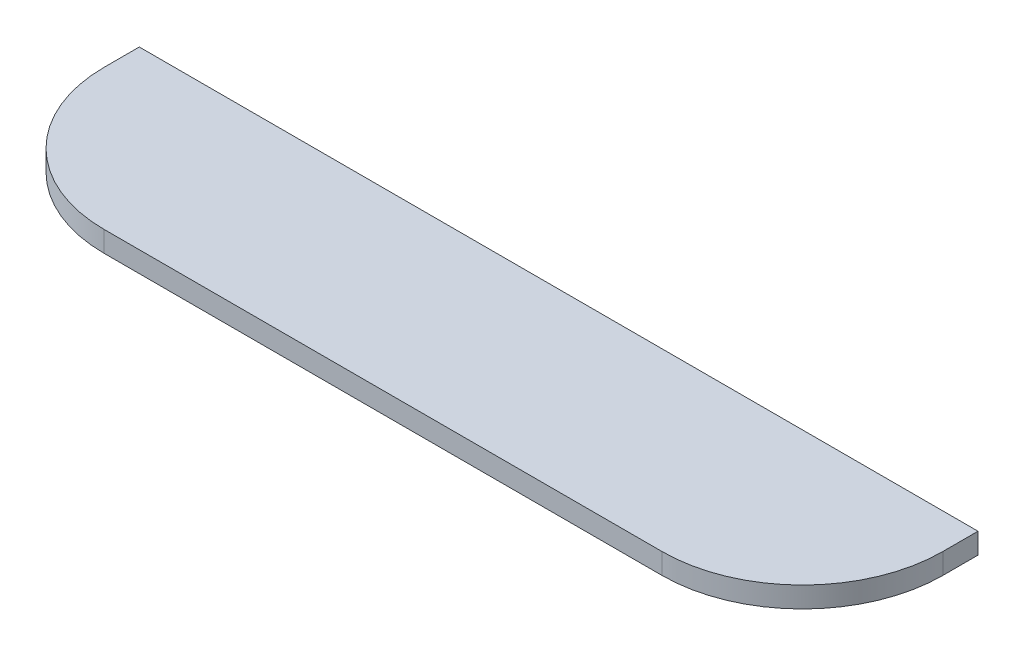
ISO-10303-21;
HEADER;
FILE_DESCRIPTION(('STEP AP214'),'2;1');
FILE_NAME('part.step','',(''),(''),'','','');
FILE_SCHEMA(('AUTOMOTIVE_DESIGN { 1 0 10303 214 1 1 1 1 }'));
ENDSEC;
DATA;
#1=APPLICATION_CONTEXT('core data for automotive mechanical design processes');
#2=APPLICATION_PROTOCOL_DEFINITION('international standard','automotive_design',2000,#1);
#3=PRODUCT_CONTEXT('',#1,'mechanical');
#4=PRODUCT('Part','Part','',(#3));
#5=PRODUCT_RELATED_PRODUCT_CATEGORY('part','',(#4));
#6=PRODUCT_DEFINITION_FORMATION('','',#4);
#7=PRODUCT_DEFINITION_CONTEXT('part definition',#1,'design');
#8=PRODUCT_DEFINITION('design','',#6,#7);
#9=PRODUCT_DEFINITION_SHAPE('','',#8);
#10=(LENGTH_UNIT() NAMED_UNIT(*) SI_UNIT(.MILLI.,.METRE.));
#11=(NAMED_UNIT(*) PLANE_ANGLE_UNIT() SI_UNIT($,.RADIAN.));
#12=(NAMED_UNIT(*) SI_UNIT($,.STERADIAN.) SOLID_ANGLE_UNIT());
#13=UNCERTAINTY_MEASURE_WITH_UNIT(LENGTH_MEASURE(1.E-05),#10,'distance_accuracy_value','');
#14=(GEOMETRIC_REPRESENTATION_CONTEXT(3) GLOBAL_UNCERTAINTY_ASSIGNED_CONTEXT((#13)) GLOBAL_UNIT_ASSIGNED_CONTEXT((#10,
#11,#12)) REPRESENTATION_CONTEXT('',''));
#15=CARTESIAN_POINT('',(0.,0.,0.));
#16=DIRECTION('',(0.,0.,1.));
#17=DIRECTION('',(1.,0.,0.));
#18=AXIS2_PLACEMENT_3D('',#15,#16,#17);
#19=CARTESIAN_POINT('',(60.665,1.5,25.4));
#20=DIRECTION('',(-1.,0.,0.));
#21=DIRECTION('',(0.,0.,1.));
#22=AXIS2_PLACEMENT_3D('',#19,#20,#21);
#23=PLANE('',#22);
#24=DIRECTION('',(0.,0.,-1.));
#25=VECTOR('',#24,1.);
#26=CARTESIAN_POINT('',(60.665,1.5,25.4));
#27=LINE('',#26,#25);
#28=CARTESIAN_POINT('',(60.665,1.5,5.08));
#29=VERTEX_POINT('',#28);
#30=CARTESIAN_POINT('',(60.665,1.5,0.));
#31=VERTEX_POINT('',#30);
#32=EDGE_CURVE('E84',#29,#31,#27,.T.);
#33=ORIENTED_EDGE('',*,*,#32,.F.);
#34=DIRECTION('',(0.,1.,0.));
#35=VECTOR('',#34,1.);
#36=CARTESIAN_POINT('',(60.665,-1.5,5.08));
#37=LINE('',#36,#35);
#38=CARTESIAN_POINT('',(60.665,-1.5,5.08));
#39=VERTEX_POINT('',#38);
#40=EDGE_CURVE('E55',#29,#39,#37,.F.);
#41=ORIENTED_EDGE('',*,*,#40,.T.);
#42=DIRECTION('',(0.,0.,-1.));
#43=VECTOR('',#42,1.);
#44=CARTESIAN_POINT('',(60.665,-1.5,25.4));
#45=LINE('',#44,#43);
#46=CARTESIAN_POINT('',(60.665,-1.5,0.));
#47=VERTEX_POINT('',#46);
#48=EDGE_CURVE('E104',#39,#47,#45,.T.);
#49=ORIENTED_EDGE('',*,*,#48,.T.);
#50=DIRECTION('',(0.,1.,0.));
#51=VECTOR('',#50,1.);
#52=CARTESIAN_POINT('',(60.665,1.5,0.));
#53=LINE('',#52,#51);
#54=EDGE_CURVE('E100',#47,#31,#53,.T.);
#55=ORIENTED_EDGE('',*,*,#54,.T.);
#56=EDGE_LOOP('',(#33,#41,#49,#55));
#57=FACE_BOUND('',#56,.T.);
#58=ADVANCED_FACE('F32',(#57),#23,.F.);
#59=CARTESIAN_POINT('',(-60.665,1.5,25.4));
#60=DIRECTION('',(0.,-1.,0.));
#61=DIRECTION('',(0.,0.,-1.));
#62=AXIS2_PLACEMENT_3D('',#59,#60,#61);
#63=PLANE('',#62);
#64=DIRECTION('',(-1.,0.,0.));
#65=VECTOR('',#64,1.);
#66=CARTESIAN_POINT('',(-60.665,1.5,25.4));
#67=LINE('',#66,#65);
#68=CARTESIAN_POINT('',(40.345,1.5,25.4));
#69=VERTEX_POINT('',#68);
#70=CARTESIAN_POINT('',(-40.345,1.5,25.4));
#71=VERTEX_POINT('',#70);
#72=EDGE_CURVE('E114',#69,#71,#67,.T.);
#73=ORIENTED_EDGE('',*,*,#72,.F.);
#74=CARTESIAN_POINT('',(40.345,1.5,5.08));
#75=DIRECTION('',(0.,-1.,0.));
#76=DIRECTION('',(0.,0.,-1.));
#77=AXIS2_PLACEMENT_3D('',#74,#75,#76);
#78=CIRCLE('',#77,20.32);
#79=EDGE_CURVE('E91',#69,#29,#78,.F.);
#80=ORIENTED_EDGE('',*,*,#79,.T.);
#81=ORIENTED_EDGE('',*,*,#32,.T.);
#82=DIRECTION('',(-1.,0.,0.));
#83=VECTOR('',#82,1.);
#84=CARTESIAN_POINT('',(-60.665,1.5,0.));
#85=LINE('',#84,#83);
#86=CARTESIAN_POINT('',(-60.665,1.5,0.));
#87=VERTEX_POINT('',#86);
#88=EDGE_CURVE('E89',#31,#87,#85,.T.);
#89=ORIENTED_EDGE('',*,*,#88,.T.);
#90=DIRECTION('',(0.,0.,-1.));
#91=VECTOR('',#90,1.);
#92=CARTESIAN_POINT('',(-60.665,1.5,25.4));
#93=LINE('',#92,#91);
#94=CARTESIAN_POINT('',(-60.665,1.5,5.08));
#95=VERTEX_POINT('',#94);
#96=EDGE_CURVE('E94',#95,#87,#93,.T.);
#97=ORIENTED_EDGE('',*,*,#96,.F.);
#98=CARTESIAN_POINT('',(-40.345,1.5,5.08));
#99=DIRECTION('',(0.,-1.,0.));
#100=DIRECTION('',(0.,0.,-1.));
#101=AXIS2_PLACEMENT_3D('',#98,#99,#100);
#102=CIRCLE('',#101,20.32);
#103=EDGE_CURVE('E124',#95,#71,#102,.F.);
#104=ORIENTED_EDGE('',*,*,#103,.T.);
#105=EDGE_LOOP('',(#73,#80,#81,#89,#97,#104));
#106=FACE_BOUND('',#105,.T.);
#107=ADVANCED_FACE('F87',(#106),#63,.F.);
#108=CARTESIAN_POINT('',(-60.665,1.5,25.4));
#109=DIRECTION('',(1.,0.,0.));
#110=DIRECTION('',(0.,0.,-1.));
#111=AXIS2_PLACEMENT_3D('',#108,#109,#110);
#112=PLANE('',#111);
#113=DIRECTION('',(0.,0.,-1.));
#114=VECTOR('',#113,1.);
#115=CARTESIAN_POINT('',(-60.665,-1.5,25.4));
#116=LINE('',#115,#114);
#117=CARTESIAN_POINT('',(-60.665,-1.5,5.08));
#118=VERTEX_POINT('',#117);
#119=CARTESIAN_POINT('',(-60.665,-1.5,0.));
#120=VERTEX_POINT('',#119);
#121=EDGE_CURVE('E116',#118,#120,#116,.T.);
#122=ORIENTED_EDGE('',*,*,#121,.F.);
#123=DIRECTION('',(0.,-1.,0.));
#124=VECTOR('',#123,1.);
#125=CARTESIAN_POINT('',(-60.665,1.5,5.08));
#126=LINE('',#125,#124);
#127=EDGE_CURVE('E11',#118,#95,#126,.F.);
#128=ORIENTED_EDGE('',*,*,#127,.T.);
#129=ORIENTED_EDGE('',*,*,#96,.T.);
#130=DIRECTION('',(0.,-1.,0.));
#131=VECTOR('',#130,1.);
#132=CARTESIAN_POINT('',(-60.665,1.5,0.));
#133=LINE('',#132,#131);
#134=EDGE_CURVE('E102',#87,#120,#133,.T.);
#135=ORIENTED_EDGE('',*,*,#134,.T.);
#136=EDGE_LOOP('',(#122,#128,#129,#135));
#137=FACE_BOUND('',#136,.T.);
#138=ADVANCED_FACE('F150',(#137),#112,.F.);
#139=CARTESIAN_POINT('',(-60.665,-1.5,25.4));
#140=DIRECTION('',(0.,1.,0.));
#141=DIRECTION('',(0.,0.,1.));
#142=AXIS2_PLACEMENT_3D('',#139,#140,#141);
#143=PLANE('',#142);
#144=ORIENTED_EDGE('',*,*,#48,.F.);
#145=CARTESIAN_POINT('',(40.345,-1.5,5.08));
#146=DIRECTION('',(0.,1.,0.));
#147=DIRECTION('',(0.,0.,1.));
#148=AXIS2_PLACEMENT_3D('',#145,#146,#147);
#149=CIRCLE('',#148,20.32);
#150=CARTESIAN_POINT('',(40.345,-1.5,25.4));
#151=VERTEX_POINT('',#150);
#152=EDGE_CURVE('E40',#39,#151,#149,.F.);
#153=ORIENTED_EDGE('',*,*,#152,.T.);
#154=DIRECTION('',(1.,0.,0.));
#155=VECTOR('',#154,1.);
#156=CARTESIAN_POINT('',(-60.665,-1.5,25.4));
#157=LINE('',#156,#155);
#158=CARTESIAN_POINT('',(-40.345,-1.5,25.4));
#159=VERTEX_POINT('',#158);
#160=EDGE_CURVE('E108',#159,#151,#157,.T.);
#161=ORIENTED_EDGE('',*,*,#160,.F.);
#162=CARTESIAN_POINT('',(-40.345,-1.5,5.08));
#163=DIRECTION('',(0.,1.,0.));
#164=DIRECTION('',(0.,0.,1.));
#165=AXIS2_PLACEMENT_3D('',#162,#163,#164);
#166=CIRCLE('',#165,20.32);
#167=EDGE_CURVE('E47',#159,#118,#166,.F.);
#168=ORIENTED_EDGE('',*,*,#167,.T.);
#169=ORIENTED_EDGE('',*,*,#121,.T.);
#170=DIRECTION('',(1.,0.,0.));
#171=VECTOR('',#170,1.);
#172=CARTESIAN_POINT('',(-60.665,-1.5,0.));
#173=LINE('',#172,#171);
#174=EDGE_CURVE('E112',#120,#47,#173,.T.);
#175=ORIENTED_EDGE('',*,*,#174,.T.);
#176=EDGE_LOOP('',(#144,#153,#161,#168,#169,#175));
#177=FACE_BOUND('',#176,.T.);
#178=ADVANCED_FACE('F130',(#177),#143,.F.);
#179=CARTESIAN_POINT('',(0.,0.,25.4));
#180=DIRECTION('',(0.,0.,1.));
#181=DIRECTION('',(1.,0.,0.));
#182=AXIS2_PLACEMENT_3D('',#179,#180,#181);
#183=PLANE('',#182);
#184=ORIENTED_EDGE('',*,*,#160,.T.);
#185=DIRECTION('',(0.,1.,0.));
#186=VECTOR('',#185,1.);
#187=CARTESIAN_POINT('',(40.345,1.5,25.4));
#188=LINE('',#187,#186);
#189=EDGE_CURVE('E121',#151,#69,#188,.T.);
#190=ORIENTED_EDGE('',*,*,#189,.T.);
#191=ORIENTED_EDGE('',*,*,#72,.T.);
#192=DIRECTION('',(0.,-1.,0.));
#193=VECTOR('',#192,1.);
#194=CARTESIAN_POINT('',(-40.345,-1.5,25.4));
#195=LINE('',#194,#193);
#196=EDGE_CURVE('E93',#71,#159,#195,.T.);
#197=ORIENTED_EDGE('',*,*,#196,.T.);
#198=EDGE_LOOP('',(#184,#190,#191,#197));
#199=FACE_BOUND('',#198,.T.);
#200=ADVANCED_FACE('F134',(#199),#183,.T.);
#201=CARTESIAN_POINT('',(0.,0.,0.));
#202=DIRECTION('',(0.,0.,1.));
#203=DIRECTION('',(1.,0.,0.));
#204=AXIS2_PLACEMENT_3D('',#201,#202,#203);
#205=PLANE('',#204);
#206=ORIENTED_EDGE('',*,*,#54,.F.);
#207=ORIENTED_EDGE('',*,*,#174,.F.);
#208=ORIENTED_EDGE('',*,*,#134,.F.);
#209=ORIENTED_EDGE('',*,*,#88,.F.);
#210=EDGE_LOOP('',(#206,#207,#208,#209));
#211=FACE_BOUND('',#210,.T.);
#212=ADVANCED_FACE('F98',(#211),#205,.F.);
#213=CARTESIAN_POINT('',(40.345,0.,5.08));
#214=DIRECTION('',(0.,-1.,0.));
#215=DIRECTION('',(0.,0.,-1.));
#216=AXIS2_PLACEMENT_3D('',#213,#214,#215);
#217=CYLINDRICAL_SURFACE('',#216,20.32);
#218=ORIENTED_EDGE('',*,*,#152,.F.);
#219=ORIENTED_EDGE('',*,*,#40,.F.);
#220=ORIENTED_EDGE('',*,*,#79,.F.);
#221=ORIENTED_EDGE('',*,*,#189,.F.);
#222=EDGE_LOOP('',(#218,#219,#220,#221));
#223=FACE_BOUND('',#222,.T.);
#224=ADVANCED_FACE('F137',(#223),#217,.T.);
#225=CARTESIAN_POINT('',(-40.345,0.,5.08));
#226=DIRECTION('',(0.,1.,0.));
#227=DIRECTION('',(0.,0.,1.));
#228=AXIS2_PLACEMENT_3D('',#225,#226,#227);
#229=CYLINDRICAL_SURFACE('',#228,20.32);
#230=ORIENTED_EDGE('',*,*,#103,.F.);
#231=ORIENTED_EDGE('',*,*,#127,.F.);
#232=ORIENTED_EDGE('',*,*,#167,.F.);
#233=ORIENTED_EDGE('',*,*,#196,.F.);
#234=EDGE_LOOP('',(#230,#231,#232,#233));
#235=FACE_BOUND('',#234,.T.);
#236=ADVANCED_FACE('F34',(#235),#229,.T.);
#237=CLOSED_SHELL('',(#58,#107,#138,#178,#200,#212,#224,#236));
#238=MANIFOLD_SOLID_BREP('B2',#237);
#239=ADVANCED_BREP_SHAPE_REPRESENTATION('',(#18,#238),#14);
#240=SHAPE_DEFINITION_REPRESENTATION(#9,#239);
ENDSEC;
END-ISO-10303-21;
